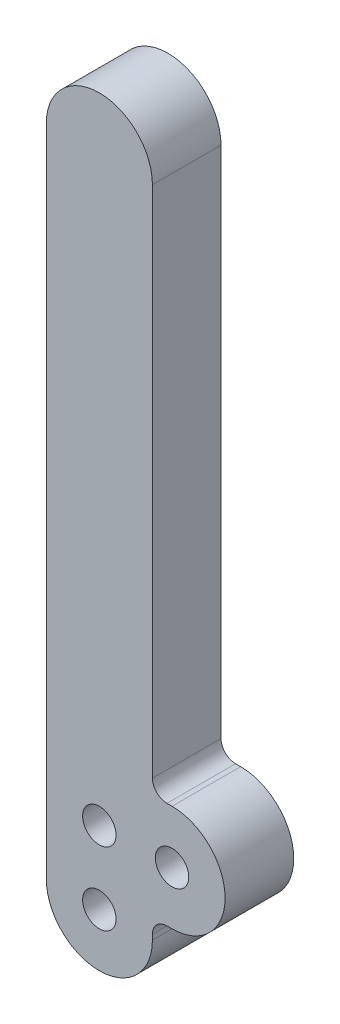
ISO-10303-21;
HEADER;
FILE_DESCRIPTION(('STEP AP214'),'2;1');
FILE_NAME('part.step','',(''),(''),'','','');
FILE_SCHEMA(('AUTOMOTIVE_DESIGN { 1 0 10303 214 1 1 1 1 }'));
ENDSEC;
DATA;
#1=APPLICATION_CONTEXT('core data for automotive mechanical design processes');
#2=APPLICATION_PROTOCOL_DEFINITION('international standard','automotive_design',2000,#1);
#3=PRODUCT_CONTEXT('',#1,'mechanical');
#4=PRODUCT('Part','Part','',(#3));
#5=PRODUCT_RELATED_PRODUCT_CATEGORY('part','',(#4));
#6=PRODUCT_DEFINITION_FORMATION('','',#4);
#7=PRODUCT_DEFINITION_CONTEXT('part definition',#1,'design');
#8=PRODUCT_DEFINITION('design','',#6,#7);
#9=PRODUCT_DEFINITION_SHAPE('','',#8);
#10=(LENGTH_UNIT() NAMED_UNIT(*) SI_UNIT(.MILLI.,.METRE.));
#11=(NAMED_UNIT(*) PLANE_ANGLE_UNIT() SI_UNIT($,.RADIAN.));
#12=(NAMED_UNIT(*) SI_UNIT($,.STERADIAN.) SOLID_ANGLE_UNIT());
#13=UNCERTAINTY_MEASURE_WITH_UNIT(LENGTH_MEASURE(1.E-05),#10,'distance_accuracy_value','');
#14=(GEOMETRIC_REPRESENTATION_CONTEXT(3) GLOBAL_UNCERTAINTY_ASSIGNED_CONTEXT((#13)) GLOBAL_UNIT_ASSIGNED_CONTEXT((#10,
#11,#12)) REPRESENTATION_CONTEXT('',''));
#15=CARTESIAN_POINT('',(0.,0.,0.));
#16=DIRECTION('',(0.,0.,1.));
#17=DIRECTION('',(1.,0.,0.));
#18=AXIS2_PLACEMENT_3D('',#15,#16,#17);
#19=CARTESIAN_POINT('',(0.,57.15,5.9944));
#20=DIRECTION('',(0.,0.,1.));
#21=DIRECTION('',(1.,0.,0.));
#22=AXIS2_PLACEMENT_3D('',#19,#20,#21);
#23=PLANE('',#22);
#24=CARTESIAN_POINT('',(0.,6.35,5.9944));
#25=DIRECTION('',(0.,0.,1.));
#26=DIRECTION('',(1.,0.,0.));
#27=AXIS2_PLACEMENT_3D('',#24,#25,#26);
#28=CIRCLE('',#27,1.4605);
#29=CARTESIAN_POINT('',(1.4605,6.35,5.9944));
#30=VERTEX_POINT('',#29);
#31=EDGE_CURVE('E211',#30,#30,#28,.T.);
#32=ORIENTED_EDGE('',*,*,#31,.F.);
#33=EDGE_LOOP('',(#32));
#34=FACE_BOUND('',#33,.T.);
#35=CARTESIAN_POINT('',(0.,57.15,5.9944));
#36=DIRECTION('',(0.,0.,1.));
#37=DIRECTION('',(1.,0.,0.));
#38=AXIS2_PLACEMENT_3D('',#35,#36,#37);
#39=CIRCLE('',#38,4.6355);
#40=CARTESIAN_POINT('',(4.6355,57.15,5.9944));
#41=VERTEX_POINT('',#40);
#42=CARTESIAN_POINT('',(-4.6355,57.15,5.9944));
#43=VERTEX_POINT('',#42);
#44=EDGE_CURVE('E160',#41,#43,#39,.T.);
#45=ORIENTED_EDGE('',*,*,#44,.T.);
#46=DIRECTION('',(0.,-1.,0.));
#47=VECTOR('',#46,1.);
#48=CARTESIAN_POINT('',(-4.6355,0.,5.9944));
#49=LINE('',#48,#47);
#50=CARTESIAN_POINT('',(-4.6355,0.,5.9944));
#51=VERTEX_POINT('',#50);
#52=EDGE_CURVE('E98',#43,#51,#49,.T.);
#53=ORIENTED_EDGE('',*,*,#52,.T.);
#54=CARTESIAN_POINT('',(0.,0.,5.9944));
#55=DIRECTION('',(0.,0.,1.));
#56=DIRECTION('',(1.,0.,0.));
#57=AXIS2_PLACEMENT_3D('',#54,#55,#56);
#58=CIRCLE('',#57,4.6355);
#59=CARTESIAN_POINT('',(4.6355,0.,5.9944));
#60=VERTEX_POINT('',#59);
#61=EDGE_CURVE('E181',#51,#60,#58,.T.);
#62=ORIENTED_EDGE('',*,*,#61,.T.);
#63=DIRECTION('',(0.,1.,0.));
#64=VECTOR('',#63,1.);
#65=CARTESIAN_POINT('',(4.6355,0.,5.9944));
#66=LINE('',#65,#64);
#67=CARTESIAN_POINT('',(4.6355,0.4445,5.9944));
#68=VERTEX_POINT('',#67);
#69=EDGE_CURVE('E200',#60,#68,#66,.T.);
#70=ORIENTED_EDGE('',*,*,#69,.T.);
#71=CARTESIAN_POINT('',(5.9055,0.4445,5.9944));
#72=DIRECTION('',(0.,0.,-1.));
#73=DIRECTION('',(-1.,0.,0.));
#74=AXIS2_PLACEMENT_3D('',#71,#72,#73);
#75=CIRCLE('',#74,1.27);
#76=CARTESIAN_POINT('',(5.9055,1.7145,5.9944));
#77=VERTEX_POINT('',#76);
#78=EDGE_CURVE('E197',#68,#77,#75,.T.);
#79=ORIENTED_EDGE('',*,*,#78,.T.);
#80=DIRECTION('',(1.,0.,0.));
#81=VECTOR('',#80,1.);
#82=CARTESIAN_POINT('',(5.9055,1.7145,5.9944));
#83=LINE('',#82,#81);
#84=CARTESIAN_POINT('',(6.35,1.7145,5.9944));
#85=VERTEX_POINT('',#84);
#86=EDGE_CURVE('E199',#77,#85,#83,.T.);
#87=ORIENTED_EDGE('',*,*,#86,.T.);
#88=CARTESIAN_POINT('',(6.35,6.35,5.9944));
#89=DIRECTION('',(0.,0.,1.));
#90=DIRECTION('',(1.,0.,0.));
#91=AXIS2_PLACEMENT_3D('',#88,#89,#90);
#92=CIRCLE('',#91,4.6355);
#93=CARTESIAN_POINT('',(6.35,10.9855,5.9944));
#94=VERTEX_POINT('',#93);
#95=EDGE_CURVE('E123',#85,#94,#92,.T.);
#96=ORIENTED_EDGE('',*,*,#95,.T.);
#97=DIRECTION('',(-1.,0.,0.));
#98=VECTOR('',#97,1.);
#99=CARTESIAN_POINT('',(6.35,10.9855,5.9944));
#100=LINE('',#99,#98);
#101=CARTESIAN_POINT('',(5.9055,10.9855,5.9944));
#102=VERTEX_POINT('',#101);
#103=EDGE_CURVE('E117',#94,#102,#100,.T.);
#104=ORIENTED_EDGE('',*,*,#103,.T.);
#105=CARTESIAN_POINT('',(5.9055,12.2555,5.9944));
#106=DIRECTION('',(0.,0.,-1.));
#107=DIRECTION('',(1.,0.,0.));
#108=AXIS2_PLACEMENT_3D('',#105,#106,#107);
#109=CIRCLE('',#108,1.27);
#110=CARTESIAN_POINT('',(4.6355,12.2555,5.9944));
#111=VERTEX_POINT('',#110);
#112=EDGE_CURVE('E121',#102,#111,#109,.T.);
#113=ORIENTED_EDGE('',*,*,#112,.T.);
#114=DIRECTION('',(0.,1.,0.));
#115=VECTOR('',#114,1.);
#116=CARTESIAN_POINT('',(4.6355,12.2555,5.9944));
#117=LINE('',#116,#115);
#118=EDGE_CURVE('E49',#111,#41,#117,.T.);
#119=ORIENTED_EDGE('',*,*,#118,.T.);
#120=EDGE_LOOP('',(#45,#53,#62,#70,#79,#87,#96,#104,#113,#119));
#121=FACE_BOUND('',#120,.T.);
#122=CARTESIAN_POINT('',(0.,0.,5.9944));
#123=DIRECTION('',(0.,0.,1.));
#124=DIRECTION('',(1.,0.,0.));
#125=AXIS2_PLACEMENT_3D('',#122,#123,#124);
#126=CIRCLE('',#125,1.4605);
#127=CARTESIAN_POINT('',(1.4605,0.,5.9944));
#128=VERTEX_POINT('',#127);
#129=EDGE_CURVE('E145',#128,#128,#126,.T.);
#130=ORIENTED_EDGE('',*,*,#129,.F.);
#131=EDGE_LOOP('',(#130));
#132=FACE_BOUND('',#131,.T.);
#133=CARTESIAN_POINT('',(6.35,6.35,5.9944));
#134=DIRECTION('',(0.,0.,1.));
#135=DIRECTION('',(1.,0.,0.));
#136=AXIS2_PLACEMENT_3D('',#133,#134,#135);
#137=CIRCLE('',#136,1.4605);
#138=CARTESIAN_POINT('',(7.8105,6.35,5.9944));
#139=VERTEX_POINT('',#138);
#140=EDGE_CURVE('E217',#139,#139,#137,.T.);
#141=ORIENTED_EDGE('',*,*,#140,.F.);
#142=EDGE_LOOP('',(#141));
#143=FACE_BOUND('',#142,.T.);
#144=ADVANCED_FACE('F32',(#34,#121,#132,#143),#23,.T.);
#145=CARTESIAN_POINT('',(0.,57.15,0.));
#146=DIRECTION('',(0.,0.,1.));
#147=DIRECTION('',(1.,0.,0.));
#148=AXIS2_PLACEMENT_3D('',#145,#146,#147);
#149=PLANE('',#148);
#150=CARTESIAN_POINT('',(0.,57.15,0.));
#151=DIRECTION('',(0.,0.,1.));
#152=DIRECTION('',(1.,0.,0.));
#153=AXIS2_PLACEMENT_3D('',#150,#151,#152);
#154=CIRCLE('',#153,4.6355);
#155=CARTESIAN_POINT('',(4.6355,57.15,0.));
#156=VERTEX_POINT('',#155);
#157=CARTESIAN_POINT('',(-4.6355,57.15,0.));
#158=VERTEX_POINT('',#157);
#159=EDGE_CURVE('E141',#156,#158,#154,.T.);
#160=ORIENTED_EDGE('',*,*,#159,.F.);
#161=DIRECTION('',(0.,1.,0.));
#162=VECTOR('',#161,1.);
#163=CARTESIAN_POINT('',(4.6355,12.2555,0.));
#164=LINE('',#163,#162);
#165=CARTESIAN_POINT('',(4.6355,12.2555,0.));
#166=VERTEX_POINT('',#165);
#167=EDGE_CURVE('E90',#166,#156,#164,.T.);
#168=ORIENTED_EDGE('',*,*,#167,.F.);
#169=CARTESIAN_POINT('',(5.9055,12.2555,0.));
#170=DIRECTION('',(0.,0.,-1.));
#171=DIRECTION('',(1.,0.,0.));
#172=AXIS2_PLACEMENT_3D('',#169,#170,#171);
#173=CIRCLE('',#172,1.27);
#174=CARTESIAN_POINT('',(5.9055,10.9855,0.));
#175=VERTEX_POINT('',#174);
#176=EDGE_CURVE('E84',#175,#166,#173,.T.);
#177=ORIENTED_EDGE('',*,*,#176,.F.);
#178=DIRECTION('',(-1.,0.,0.));
#179=VECTOR('',#178,1.);
#180=CARTESIAN_POINT('',(6.35,10.9855,0.));
#181=LINE('',#180,#179);
#182=CARTESIAN_POINT('',(6.35,10.9855,0.));
#183=VERTEX_POINT('',#182);
#184=EDGE_CURVE('E131',#183,#175,#181,.T.);
#185=ORIENTED_EDGE('',*,*,#184,.F.);
#186=CARTESIAN_POINT('',(6.35,6.35,0.));
#187=DIRECTION('',(0.,0.,1.));
#188=DIRECTION('',(1.,0.,0.));
#189=AXIS2_PLACEMENT_3D('',#186,#187,#188);
#190=CIRCLE('',#189,4.6355);
#191=CARTESIAN_POINT('',(6.35,1.7145,0.));
#192=VERTEX_POINT('',#191);
#193=EDGE_CURVE('E155',#192,#183,#190,.T.);
#194=ORIENTED_EDGE('',*,*,#193,.F.);
#195=DIRECTION('',(1.,0.,0.));
#196=VECTOR('',#195,1.);
#197=CARTESIAN_POINT('',(5.9055,1.7145,0.));
#198=LINE('',#197,#196);
#199=CARTESIAN_POINT('',(5.9055,1.7145,0.));
#200=VERTEX_POINT('',#199);
#201=EDGE_CURVE('E153',#200,#192,#198,.T.);
#202=ORIENTED_EDGE('',*,*,#201,.F.);
#203=CARTESIAN_POINT('',(5.9055,0.4445,0.));
#204=DIRECTION('',(0.,0.,-1.));
#205=DIRECTION('',(-1.,0.,0.));
#206=AXIS2_PLACEMENT_3D('',#203,#204,#205);
#207=CIRCLE('',#206,1.27);
#208=CARTESIAN_POINT('',(4.6355,0.4445,0.));
#209=VERTEX_POINT('',#208);
#210=EDGE_CURVE('E151',#209,#200,#207,.T.);
#211=ORIENTED_EDGE('',*,*,#210,.F.);
#212=DIRECTION('',(0.,1.,0.));
#213=VECTOR('',#212,1.);
#214=CARTESIAN_POINT('',(4.6355,0.,0.));
#215=LINE('',#214,#213);
#216=CARTESIAN_POINT('',(4.6355,0.,0.));
#217=VERTEX_POINT('',#216);
#218=EDGE_CURVE('E149',#217,#209,#215,.T.);
#219=ORIENTED_EDGE('',*,*,#218,.F.);
#220=CARTESIAN_POINT('',(0.,0.,0.));
#221=DIRECTION('',(0.,0.,1.));
#222=DIRECTION('',(1.,0.,0.));
#223=AXIS2_PLACEMENT_3D('',#220,#221,#222);
#224=CIRCLE('',#223,4.6355);
#225=CARTESIAN_POINT('',(-4.6355,0.,0.));
#226=VERTEX_POINT('',#225);
#227=EDGE_CURVE('E147',#226,#217,#224,.T.);
#228=ORIENTED_EDGE('',*,*,#227,.F.);
#229=DIRECTION('',(0.,-1.,0.));
#230=VECTOR('',#229,1.);
#231=CARTESIAN_POINT('',(-4.6355,0.,0.));
#232=LINE('',#231,#230);
#233=EDGE_CURVE('E144',#158,#226,#232,.T.);
#234=ORIENTED_EDGE('',*,*,#233,.F.);
#235=EDGE_LOOP('',(#160,#168,#177,#185,#194,#202,#211,#219,#228,#234));
#236=FACE_BOUND('',#235,.T.);
#237=CARTESIAN_POINT('',(0.,0.,0.));
#238=DIRECTION('',(0.,0.,1.));
#239=DIRECTION('',(1.,0.,0.));
#240=AXIS2_PLACEMENT_3D('',#237,#238,#239);
#241=CIRCLE('',#240,1.4605);
#242=CARTESIAN_POINT('',(1.4605,0.,0.));
#243=VERTEX_POINT('',#242);
#244=EDGE_CURVE('E208',#243,#243,#241,.T.);
#245=ORIENTED_EDGE('',*,*,#244,.T.);
#246=EDGE_LOOP('',(#245));
#247=FACE_BOUND('',#246,.T.);
#248=CARTESIAN_POINT('',(0.,6.35,0.));
#249=DIRECTION('',(0.,0.,1.));
#250=DIRECTION('',(1.,0.,0.));
#251=AXIS2_PLACEMENT_3D('',#248,#249,#250);
#252=CIRCLE('',#251,1.4605);
#253=CARTESIAN_POINT('',(1.4605,6.35,0.));
#254=VERTEX_POINT('',#253);
#255=EDGE_CURVE('E214',#254,#254,#252,.T.);
#256=ORIENTED_EDGE('',*,*,#255,.T.);
#257=EDGE_LOOP('',(#256));
#258=FACE_BOUND('',#257,.T.);
#259=CARTESIAN_POINT('',(6.35,6.35,0.));
#260=DIRECTION('',(0.,0.,1.));
#261=DIRECTION('',(1.,0.,0.));
#262=AXIS2_PLACEMENT_3D('',#259,#260,#261);
#263=CIRCLE('',#262,1.4605);
#264=CARTESIAN_POINT('',(7.8105,6.35,0.));
#265=VERTEX_POINT('',#264);
#266=EDGE_CURVE('E220',#265,#265,#263,.T.);
#267=ORIENTED_EDGE('',*,*,#266,.T.);
#268=EDGE_LOOP('',(#267));
#269=FACE_BOUND('',#268,.T.);
#270=ADVANCED_FACE('F185',(#236,#247,#258,#269),#149,.F.);
#271=CARTESIAN_POINT('',(0.,57.15,5.9944));
#272=DIRECTION('',(0.,0.,-1.));
#273=DIRECTION('',(-1.,0.,0.));
#274=AXIS2_PLACEMENT_3D('',#271,#272,#273);
#275=CYLINDRICAL_SURFACE('',#274,4.6355);
#276=ORIENTED_EDGE('',*,*,#159,.T.);
#277=DIRECTION('',(0.,0.,-1.));
#278=VECTOR('',#277,1.);
#279=CARTESIAN_POINT('',(-4.6355,57.15,5.9944));
#280=LINE('',#279,#278);
#281=EDGE_CURVE('E11',#43,#158,#280,.T.);
#282=ORIENTED_EDGE('',*,*,#281,.F.);
#283=ORIENTED_EDGE('',*,*,#44,.F.);
#284=DIRECTION('',(0.,0.,-1.));
#285=VECTOR('',#284,1.);
#286=CARTESIAN_POINT('',(4.6355,57.15,5.9944));
#287=LINE('',#286,#285);
#288=EDGE_CURVE('E137',#41,#156,#287,.T.);
#289=ORIENTED_EDGE('',*,*,#288,.T.);
#290=EDGE_LOOP('',(#276,#282,#283,#289));
#291=FACE_BOUND('',#290,.T.);
#292=ADVANCED_FACE('F34',(#291),#275,.T.);
#293=CARTESIAN_POINT('',(-4.6355,0.,5.9944));
#294=DIRECTION('',(1.,0.,0.));
#295=DIRECTION('',(0.,0.,-1.));
#296=AXIS2_PLACEMENT_3D('',#293,#294,#295);
#297=PLANE('',#296);
#298=ORIENTED_EDGE('',*,*,#233,.T.);
#299=DIRECTION('',(0.,0.,-1.));
#300=VECTOR('',#299,1.);
#301=CARTESIAN_POINT('',(-4.6355,0.,5.9944));
#302=LINE('',#301,#300);
#303=EDGE_CURVE('E41',#51,#226,#302,.T.);
#304=ORIENTED_EDGE('',*,*,#303,.F.);
#305=ORIENTED_EDGE('',*,*,#52,.F.);
#306=ORIENTED_EDGE('',*,*,#281,.T.);
#307=EDGE_LOOP('',(#298,#304,#305,#306));
#308=FACE_BOUND('',#307,.T.);
#309=ADVANCED_FACE('F261',(#308),#297,.F.);
#310=CARTESIAN_POINT('',(0.,0.,5.9944));
#311=DIRECTION('',(0.,0.,-1.));
#312=DIRECTION('',(-1.,0.,0.));
#313=AXIS2_PLACEMENT_3D('',#310,#311,#312);
#314=CYLINDRICAL_SURFACE('',#313,4.6355);
#315=ORIENTED_EDGE('',*,*,#227,.T.);
#316=DIRECTION('',(0.,0.,-1.));
#317=VECTOR('',#316,1.);
#318=CARTESIAN_POINT('',(4.6355,0.,5.9944));
#319=LINE('',#318,#317);
#320=EDGE_CURVE('E173',#60,#217,#319,.T.);
#321=ORIENTED_EDGE('',*,*,#320,.F.);
#322=ORIENTED_EDGE('',*,*,#61,.F.);
#323=ORIENTED_EDGE('',*,*,#303,.T.);
#324=EDGE_LOOP('',(#315,#321,#322,#323));
#325=FACE_BOUND('',#324,.T.);
#326=ADVANCED_FACE('F179',(#325),#314,.T.);
#327=CARTESIAN_POINT('',(4.6355,0.,5.9944));
#328=DIRECTION('',(-1.,0.,0.));
#329=DIRECTION('',(0.,-1.,0.));
#330=AXIS2_PLACEMENT_3D('',#327,#328,#329);
#331=PLANE('',#330);
#332=ORIENTED_EDGE('',*,*,#218,.T.);
#333=DIRECTION('',(0.,0.,-1.));
#334=VECTOR('',#333,1.);
#335=CARTESIAN_POINT('',(4.6355,0.4445,5.9944));
#336=LINE('',#335,#334);
#337=EDGE_CURVE('E170',#68,#209,#336,.T.);
#338=ORIENTED_EDGE('',*,*,#337,.F.);
#339=ORIENTED_EDGE('',*,*,#69,.F.);
#340=ORIENTED_EDGE('',*,*,#320,.T.);
#341=EDGE_LOOP('',(#332,#338,#339,#340));
#342=FACE_BOUND('',#341,.T.);
#343=ADVANCED_FACE('F191',(#342),#331,.F.);
#344=CARTESIAN_POINT('',(5.9055,0.4445,5.9944));
#345=DIRECTION('',(0.,0.,-1.));
#346=DIRECTION('',(-1.,0.,0.));
#347=AXIS2_PLACEMENT_3D('',#344,#345,#346);
#348=CYLINDRICAL_SURFACE('',#347,1.27);
#349=ORIENTED_EDGE('',*,*,#210,.T.);
#350=DIRECTION('',(0.,0.,-1.));
#351=VECTOR('',#350,1.);
#352=CARTESIAN_POINT('',(5.9055,1.7145,5.9944));
#353=LINE('',#352,#351);
#354=EDGE_CURVE('E167',#77,#200,#353,.T.);
#355=ORIENTED_EDGE('',*,*,#354,.F.);
#356=ORIENTED_EDGE('',*,*,#78,.F.);
#357=ORIENTED_EDGE('',*,*,#337,.T.);
#358=EDGE_LOOP('',(#349,#355,#356,#357));
#359=FACE_BOUND('',#358,.T.);
#360=ADVANCED_FACE('F195',(#359),#348,.F.);
#361=CARTESIAN_POINT('',(5.9055,1.7145,5.9944));
#362=DIRECTION('',(0.,1.,0.));
#363=DIRECTION('',(0.,0.,1.));
#364=AXIS2_PLACEMENT_3D('',#361,#362,#363);
#365=PLANE('',#364);
#366=ORIENTED_EDGE('',*,*,#201,.T.);
#367=DIRECTION('',(0.,0.,-1.));
#368=VECTOR('',#367,1.);
#369=CARTESIAN_POINT('',(6.35,1.7145,5.9944));
#370=LINE('',#369,#368);
#371=EDGE_CURVE('E164',#85,#192,#370,.T.);
#372=ORIENTED_EDGE('',*,*,#371,.F.);
#373=ORIENTED_EDGE('',*,*,#86,.F.);
#374=ORIENTED_EDGE('',*,*,#354,.T.);
#375=EDGE_LOOP('',(#366,#372,#373,#374));
#376=FACE_BOUND('',#375,.T.);
#377=ADVANCED_FACE('F251',(#376),#365,.F.);
#378=CARTESIAN_POINT('',(6.35,6.35,5.9944));
#379=DIRECTION('',(0.,0.,-1.));
#380=DIRECTION('',(-1.,0.,0.));
#381=AXIS2_PLACEMENT_3D('',#378,#379,#380);
#382=CYLINDRICAL_SURFACE('',#381,4.6355);
#383=ORIENTED_EDGE('',*,*,#193,.T.);
#384=DIRECTION('',(0.,0.,-1.));
#385=VECTOR('',#384,1.);
#386=CARTESIAN_POINT('',(6.35,10.9855,5.9944));
#387=LINE('',#386,#385);
#388=EDGE_CURVE('E132',#94,#183,#387,.T.);
#389=ORIENTED_EDGE('',*,*,#388,.F.);
#390=ORIENTED_EDGE('',*,*,#95,.F.);
#391=ORIENTED_EDGE('',*,*,#371,.T.);
#392=EDGE_LOOP('',(#383,#389,#390,#391));
#393=FACE_BOUND('',#392,.T.);
#394=ADVANCED_FACE('F248',(#393),#382,.T.);
#395=CARTESIAN_POINT('',(6.35,10.9855,5.9944));
#396=DIRECTION('',(0.,-1.,0.));
#397=DIRECTION('',(1.,0.,0.));
#398=AXIS2_PLACEMENT_3D('',#395,#396,#397);
#399=PLANE('',#398);
#400=ORIENTED_EDGE('',*,*,#184,.T.);
#401=DIRECTION('',(0.,0.,-1.));
#402=VECTOR('',#401,1.);
#403=CARTESIAN_POINT('',(5.9055,10.9855,5.9944));
#404=LINE('',#403,#402);
#405=EDGE_CURVE('E128',#102,#175,#404,.T.);
#406=ORIENTED_EDGE('',*,*,#405,.F.);
#407=ORIENTED_EDGE('',*,*,#103,.F.);
#408=ORIENTED_EDGE('',*,*,#388,.T.);
#409=EDGE_LOOP('',(#400,#406,#407,#408));
#410=FACE_BOUND('',#409,.T.);
#411=ADVANCED_FACE('F129',(#410),#399,.F.);
#412=CARTESIAN_POINT('',(5.9055,12.2555,5.9944));
#413=DIRECTION('',(0.,0.,-1.));
#414=DIRECTION('',(-1.,0.,0.));
#415=AXIS2_PLACEMENT_3D('',#412,#413,#414);
#416=CYLINDRICAL_SURFACE('',#415,1.27);
#417=ORIENTED_EDGE('',*,*,#176,.T.);
#418=DIRECTION('',(0.,0.,-1.));
#419=VECTOR('',#418,1.);
#420=CARTESIAN_POINT('',(4.6355,12.2555,5.9944));
#421=LINE('',#420,#419);
#422=EDGE_CURVE('E133',#111,#166,#421,.T.);
#423=ORIENTED_EDGE('',*,*,#422,.F.);
#424=ORIENTED_EDGE('',*,*,#112,.F.);
#425=ORIENTED_EDGE('',*,*,#405,.T.);
#426=EDGE_LOOP('',(#417,#423,#424,#425));
#427=FACE_BOUND('',#426,.T.);
#428=ADVANCED_FACE('F135',(#427),#416,.F.);
#429=CARTESIAN_POINT('',(4.6355,12.2555,5.9944));
#430=DIRECTION('',(-1.,0.,0.));
#431=DIRECTION('',(0.,-1.,0.));
#432=AXIS2_PLACEMENT_3D('',#429,#430,#431);
#433=PLANE('',#432);
#434=ORIENTED_EDGE('',*,*,#167,.T.);
#435=ORIENTED_EDGE('',*,*,#288,.F.);
#436=ORIENTED_EDGE('',*,*,#118,.F.);
#437=ORIENTED_EDGE('',*,*,#422,.T.);
#438=EDGE_LOOP('',(#434,#435,#436,#437));
#439=FACE_BOUND('',#438,.T.);
#440=ADVANCED_FACE('F241',(#439),#433,.F.);
#441=CARTESIAN_POINT('',(0.,0.,5.9944));
#442=DIRECTION('',(0.,0.,-1.));
#443=DIRECTION('',(-1.,0.,0.));
#444=AXIS2_PLACEMENT_3D('',#441,#442,#443);
#445=CYLINDRICAL_SURFACE('',#444,1.4605);
#446=ORIENTED_EDGE('',*,*,#129,.T.);
#447=EDGE_LOOP('',(#446));
#448=FACE_BOUND('',#447,.T.);
#449=ORIENTED_EDGE('',*,*,#244,.F.);
#450=EDGE_LOOP('',(#449));
#451=FACE_BOUND('',#450,.T.);
#452=ADVANCED_FACE('F238',(#448,#451),#445,.F.);
#453=CARTESIAN_POINT('',(0.,6.35,5.9944));
#454=DIRECTION('',(0.,0.,-1.));
#455=DIRECTION('',(-1.,0.,0.));
#456=AXIS2_PLACEMENT_3D('',#453,#454,#455);
#457=CYLINDRICAL_SURFACE('',#456,1.4605);
#458=ORIENTED_EDGE('',*,*,#31,.T.);
#459=EDGE_LOOP('',(#458));
#460=FACE_BOUND('',#459,.T.);
#461=ORIENTED_EDGE('',*,*,#255,.F.);
#462=EDGE_LOOP('',(#461));
#463=FACE_BOUND('',#462,.T.);
#464=ADVANCED_FACE('F337',(#460,#463),#457,.F.);
#465=CARTESIAN_POINT('',(6.35,6.35,5.9944));
#466=DIRECTION('',(0.,0.,-1.));
#467=DIRECTION('',(-1.,0.,0.));
#468=AXIS2_PLACEMENT_3D('',#465,#466,#467);
#469=CYLINDRICAL_SURFACE('',#468,1.4605);
#470=ORIENTED_EDGE('',*,*,#140,.T.);
#471=EDGE_LOOP('',(#470));
#472=FACE_BOUND('',#471,.T.);
#473=ORIENTED_EDGE('',*,*,#266,.F.);
#474=EDGE_LOOP('',(#473));
#475=FACE_BOUND('',#474,.T.);
#476=ADVANCED_FACE('F226',(#472,#475),#469,.F.);
#477=CLOSED_SHELL('',(#144,#270,#292,#309,#326,#343,#360,#377,#394,#411,#428,#440,#452,#464,#476));
#478=MANIFOLD_SOLID_BREP('B2',#477);
#479=ADVANCED_BREP_SHAPE_REPRESENTATION('',(#18,#478),#14);
#480=SHAPE_DEFINITION_REPRESENTATION(#9,#479);
ENDSEC;
END-ISO-10303-21;
